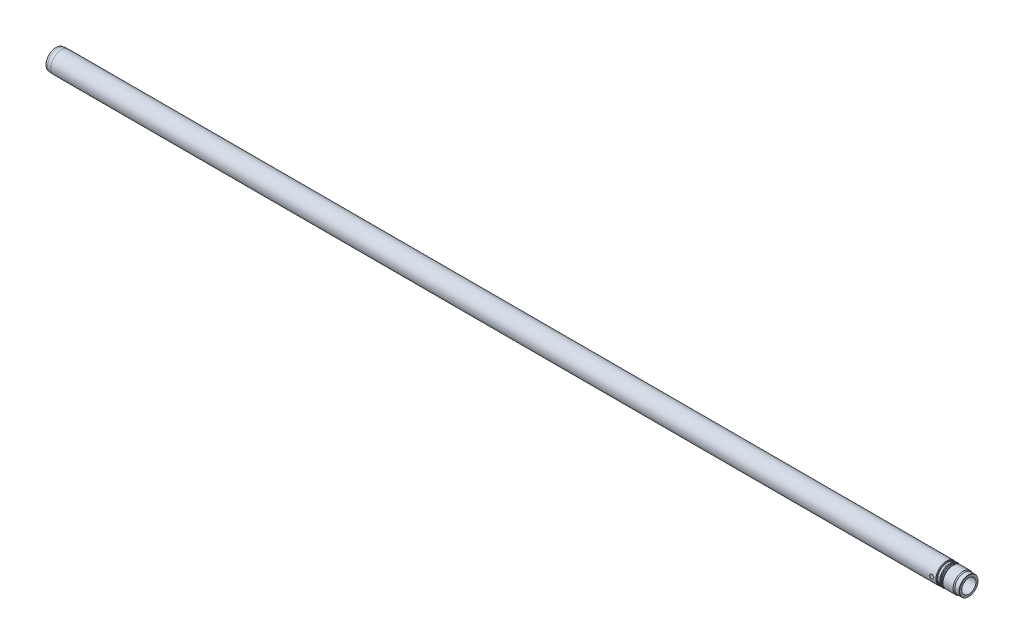
ISO-10303-21;
HEADER;
FILE_DESCRIPTION(('STEP AP214'),'2;1');
FILE_NAME('part.step','',(''),(''),'','','');
FILE_SCHEMA(('AUTOMOTIVE_DESIGN { 1 0 10303 214 1 1 1 1 }'));
ENDSEC;
DATA;
#1=APPLICATION_CONTEXT('core data for automotive mechanical design processes');
#2=APPLICATION_PROTOCOL_DEFINITION('international standard','automotive_design',2000,#1);
#3=PRODUCT_CONTEXT('',#1,'mechanical');
#4=PRODUCT('Part','Part','',(#3));
#5=PRODUCT_RELATED_PRODUCT_CATEGORY('part','',(#4));
#6=PRODUCT_DEFINITION_FORMATION('','',#4);
#7=PRODUCT_DEFINITION_CONTEXT('part definition',#1,'design');
#8=PRODUCT_DEFINITION('design','',#6,#7);
#9=PRODUCT_DEFINITION_SHAPE('','',#8);
#10=(LENGTH_UNIT() NAMED_UNIT(*) SI_UNIT(.MILLI.,.METRE.));
#11=(NAMED_UNIT(*) PLANE_ANGLE_UNIT() SI_UNIT($,.RADIAN.));
#12=(NAMED_UNIT(*) SI_UNIT($,.STERADIAN.) SOLID_ANGLE_UNIT());
#13=UNCERTAINTY_MEASURE_WITH_UNIT(LENGTH_MEASURE(1.E-05),#10,'distance_accuracy_value','');
#14=(GEOMETRIC_REPRESENTATION_CONTEXT(3) GLOBAL_UNCERTAINTY_ASSIGNED_CONTEXT((#13)) GLOBAL_UNIT_ASSIGNED_CONTEXT((#10,
#11,#12)) REPRESENTATION_CONTEXT('',''));
#15=CARTESIAN_POINT('',(0.,0.,0.));
#16=DIRECTION('',(0.,0.,1.));
#17=DIRECTION('',(1.,0.,0.));
#18=AXIS2_PLACEMENT_3D('',#15,#16,#17);
#19=CARTESIAN_POINT('',(0.,0.,0.));
#20=DIRECTION('',(-1.,0.,0.));
#21=DIRECTION('',(0.,0.,1.));
#22=AXIS2_PLACEMENT_3D('',#19,#20,#21);
#23=CONICAL_SURFACE('',#22,21.,0.5235987755983);
#24=CARTESIAN_POINT('',(6.9282032302755,0.,0.));
#25=DIRECTION('',(-1.,0.,0.));
#26=DIRECTION('',(0.,0.,1.));
#27=AXIS2_PLACEMENT_3D('',#24,#25,#26);
#28=CIRCLE('',#27,17.);
#29=CARTESIAN_POINT('',(6.9282032302755,0.,17.));
#30=VERTEX_POINT('',#29);
#31=EDGE_CURVE('E10',#30,#30,#28,.T.);
#32=ORIENTED_EDGE('',*,*,#31,.F.);
#33=EDGE_LOOP('',(#32));
#34=FACE_BOUND('',#33,.T.);
#35=CARTESIAN_POINT('',(0.,0.,0.));
#36=DIRECTION('',(-1.,0.,0.));
#37=DIRECTION('',(0.,0.,1.));
#38=AXIS2_PLACEMENT_3D('',#35,#36,#37);
#39=CIRCLE('',#38,21.);
#40=CARTESIAN_POINT('',(0.,0.,21.));
#41=VERTEX_POINT('',#40);
#42=EDGE_CURVE('E185',#41,#41,#39,.T.);
#43=ORIENTED_EDGE('',*,*,#42,.T.);
#44=EDGE_LOOP('',(#43));
#45=FACE_BOUND('',#44,.T.);
#46=ADVANCED_FACE('F43',(#34,#45),#23,.F.);
#47=CARTESIAN_POINT('',(0.,0.,0.));
#48=DIRECTION('',(-1.,0.,0.));
#49=DIRECTION('',(0.,0.,1.));
#50=AXIS2_PLACEMENT_3D('',#47,#48,#49);
#51=CYLINDRICAL_SURFACE('',#50,17.);
#52=CARTESIAN_POINT('',(2120.5,0.,17.0000000000001));
#53=CARTESIAN_POINT('',(2120.4999939727,0.248139786094189,16.9999961954987));
#54=CARTESIAN_POINT('',(2120.47940671072,0.496344480536842,16.9945135114712));
#55=CARTESIAN_POINT('',(2120.39774465018,0.98560820752433,16.973174315884));
#56=CARTESIAN_POINT('',(2120.33664995094,1.22666366691602,16.9573127053679));
#57=CARTESIAN_POINT('',(2120.17609514792,1.69449551647215,16.9169670511543));
#58=CARTESIAN_POINT('',(2120.07668410305,1.92128973608255,16.89249403667));
#59=CARTESIAN_POINT('',(2119.8424992788,2.35498604639753,16.8375143452415));
#60=CARTESIAN_POINT('',(2119.70772328063,2.5618868878873,16.8070072897539));
#61=CARTESIAN_POINT('',(2119.40337915686,2.95465619368835,16.7424751323481));
#62=CARTESIAN_POINT('',(2119.23315265612,3.14000475166026,16.7083905935436));
#63=CARTESIAN_POINT('',(2118.86414729992,3.47988446560833,16.640928241773));
#64=CARTESIAN_POINT('',(2118.66536483098,3.63441171550896,16.6075505188621));
#65=CARTESIAN_POINT('',(2118.24075395447,3.91078648059991,16.5446740227617));
#66=CARTESIAN_POINT('',(2118.01452540905,4.03203787997954,16.51525029638));
#67=CARTESIAN_POINT('',(2117.54398909092,4.23458020510499,16.4644862931428));
#68=CARTESIAN_POINT('',(2117.29968460691,4.31587837939244,16.4431445501692));
#69=CARTESIAN_POINT('',(2116.80568432275,4.43440473399748,16.4115742230544));
#70=CARTESIAN_POINT('',(2116.55622997909,4.4725746005264,16.4011085907812));
#71=CARTESIAN_POINT('',(2116.05425585675,4.50669636392591,16.3917670522188));
#72=CARTESIAN_POINT('',(2115.80173665031,4.50265602438469,16.3928890146598));
#73=CARTESIAN_POINT('',(2115.30813487029,4.45322011969829,16.4063836229733));
#74=CARTESIAN_POINT('',(2115.06692858361,4.40896191779174,16.4184468321885));
#75=CARTESIAN_POINT('',(2114.59549324368,4.28216736951903,16.4519695301458));
#76=CARTESIAN_POINT('',(2114.36526505785,4.19962800383794,16.473429760043));
#77=CARTESIAN_POINT('',(2113.91934632075,3.99768222492806,16.5236020010981));
#78=CARTESIAN_POINT('',(2113.70384627049,3.87787539054597,16.552392127192));
#79=CARTESIAN_POINT('',(2113.29560838492,3.6050749812119,16.6139379943506));
#80=CARTESIAN_POINT('',(2113.10287498213,3.45207496016852,16.6466945051376));
#81=CARTESIAN_POINT('',(2112.73914078256,3.11140669080736,16.7137721356031));
#82=CARTESIAN_POINT('',(2112.5690368451,2.9227827730169,16.7481097163477));
#83=CARTESIAN_POINT('',(2112.2626934722,2.51926736973085,16.8135364031183));
#84=CARTESIAN_POINT('',(2112.12645533296,2.3043748792807,16.8446253847784));
#85=CARTESIAN_POINT('',(2111.89132397923,1.85304666357207,16.9002386163945));
#86=CARTESIAN_POINT('',(2111.79259105471,1.61652371530397,16.9247345619699));
#87=CARTESIAN_POINT('',(2111.63654666082,1.12944054429494,16.9641969693575));
#88=CARTESIAN_POINT('',(2111.57922627709,0.878883355042802,16.979165481934));
#89=CARTESIAN_POINT('',(2111.50903761317,0.378499758438371,16.99757714526));
#90=CARTESIAN_POINT('',(2111.49494974273,0.128855796723722,17.0013364198686));
#91=CARTESIAN_POINT('',(2111.50826073824,-0.369227077901173,16.9978138879052));
#92=CARTESIAN_POINT('',(2111.53565538363,-0.617666110824258,16.9905332045684));
#93=CARTESIAN_POINT('',(2111.63015281242,-1.10194782952366,16.965952817481));
#94=CARTESIAN_POINT('',(2111.69657714815,-1.33793239097617,16.9488244024331));
#95=CARTESIAN_POINT('',(2111.86646212655,-1.79538752946389,16.9064898967349));
#96=CARTESIAN_POINT('',(2111.96992675219,-2.01685654260009,16.8812829374233));
#97=CARTESIAN_POINT('',(2112.21322970176,-2.4437464856342,16.8248446875656));
#98=CARTESIAN_POINT('',(2112.35373386753,-2.64877339136331,16.7935061472466));
#99=CARTESIAN_POINT('',(2112.66628874917,-3.03276827772521,16.7284282285679));
#100=CARTESIAN_POINT('',(2112.83834560154,-3.21173117715723,16.6946883839753));
#101=CARTESIAN_POINT('',(2113.21480997561,-3.54364355494935,16.6274504542848));
#102=CARTESIAN_POINT('',(2113.41998287879,-3.69573311976479,16.5939850732425));
#103=CARTESIAN_POINT('',(2113.8536440921,-3.96333980003505,16.5321164485774));
#104=CARTESIAN_POINT('',(2114.08213141823,-4.07885845816121,16.5037129914493));
#105=CARTESIAN_POINT('',(2114.55478257722,-4.26917454350181,16.4555094596447));
#106=CARTESIAN_POINT('',(2114.79884568015,-4.34420881494305,16.4356594855548));
#107=CARTESIAN_POINT('',(2115.29673856418,-4.45199494844993,16.4067947364221));
#108=CARTESIAN_POINT('',(2115.55056587738,-4.48475742334332,16.3977772417981));
#109=CARTESIAN_POINT('',(2116.05198474975,-4.5064661171717,16.3918232507795));
#110=CARTESIAN_POINT('',(2116.29951289327,-4.49679348202492,16.3945059290147));
#111=CARTESIAN_POINT('',(2116.78927335167,-4.4371051357649,16.4107597380706));
#112=CARTESIAN_POINT('',(2117.03150579891,-4.38709043411357,16.4243305964411));
#113=CARTESIAN_POINT('',(2117.50208906434,-4.24893296579958,16.4606067002154));
#114=CARTESIAN_POINT('',(2117.73053032532,-4.16107880659355,16.4832427143122));
#115=CARTESIAN_POINT('',(2118.16960250499,-3.94996082547737,16.5351012194015));
#116=CARTESIAN_POINT('',(2118.38023066107,-3.82669152406746,16.5643247294734));
#117=CARTESIAN_POINT('',(2118.78430015737,-3.54403917830604,16.6271251137984));
#118=CARTESIAN_POINT('',(2118.97706513554,-3.38371171107476,16.6608037314859));
#119=CARTESIAN_POINT('',(2119.33340368922,-3.03329563019924,16.7281467874237));
#120=CARTESIAN_POINT('',(2119.49697017825,-2.84319981272937,16.761811220259));
#121=CARTESIAN_POINT('',(2119.79363954504,-2.43382938444715,16.8261773921791));
#122=CARTESIAN_POINT('',(2119.92603111348,-2.21402616883115,16.8568021342468));
#123=CARTESIAN_POINT('',(2120.15177475838,-1.75448140910142,16.9107999106155));
#124=CARTESIAN_POINT('',(2120.24515224208,-1.51475296330045,16.934177661824));
#125=CARTESIAN_POINT('',(2120.37783337599,-1.0632142420448,16.9679716718455));
#126=CARTESIAN_POINT('',(2120.42354035917,-0.853375925202522,16.9798953831306));
#127=CARTESIAN_POINT('',(2120.48462482595,-0.429040947974698,16.9959108172613));
#128=CARTESIAN_POINT('',(2120.50000521128,-0.214544735254488,17.0000032894191));
#129=CARTESIAN_POINT('',(2120.5,0.,17.0000000000001));
#130=B_SPLINE_CURVE_WITH_KNOTS('',3,(#52,#53,#54,#55,#56,#57,#58,#59,#60,#61,#62,#63,#64,#65,
#66,#67,#68,#69,#70,#71,#72,#73,#74,#75,#76,#77,#78,#79,#80,#81,#82,#83,#84,#85,#86,#87,#88,#89,
#90,#91,#92,#93,#94,#95,#96,#97,#98,#99,#100,#101,#102,#103,#104,#105,#106,#107,#108,#109,#110,
#111,#112,#113,#114,#115,#116,#117,#118,#119,#120,#121,#122,#123,#124,#125,#126,#127,#128,#129),
.UNSPECIFIED.,.T.,.F.,(4,2,2,2,2,2,2,2,2,2,2,2,2,2,2,2,2,2,2,2,2,2,2,2,2,2,2,2,2,2,2,2,2,2,2,2,
2,2,4),(0.,0.743632635950677,1.48763087813262,2.23067967867778,2.97377510891817,3.7321491060706,
4.49061915321902,5.26190121593441,6.03304329655961,6.78700122339544,7.54082047960317,
8.27396339050186,9.00716413574137,9.74853201191125,10.4900439902362,11.2553725952915,
12.0207304886276,12.7893235247106,13.5577510664168,14.3042921594799,15.0507573025268,
15.7846153421823,16.5185523178613,17.266707986401,18.0150093138617,18.7840807596342,
19.5531197593254,20.3176095059617,21.0819072811555,21.8215171089269,22.5611084303385,
23.295155981525,24.0293171671978,24.7847891506876,25.5404442388059,26.3119567618968,
27.0829660649108,27.7259815891752,28.3689355850576),.UNSPECIFIED.);
#131=CARTESIAN_POINT('',(2120.5,0.,17.0000000000001));
#132=VERTEX_POINT('',#131);
#133=EDGE_CURVE('E90',#132,#132,#130,.T.);
#134=ORIENTED_EDGE('',*,*,#133,.T.);
#135=EDGE_LOOP('',(#134));
#136=FACE_BOUND('',#135,.T.);
#137=CARTESIAN_POINT('',(2120.5,0.,-16.9999999999999));
#138=CARTESIAN_POINT('',(2120.4999939727,-0.248139786094141,-16.9999961954986));
#139=CARTESIAN_POINT('',(2120.47940671072,-0.496344480536796,-16.994513511471));
#140=CARTESIAN_POINT('',(2120.39774465018,-0.985608207524279,-16.9731743158839));
#141=CARTESIAN_POINT('',(2120.33664995094,-1.22666366691596,-16.9573127053677));
#142=CARTESIAN_POINT('',(2120.17609514792,-1.69449551647217,-16.9169670511541));
#143=CARTESIAN_POINT('',(2120.07668410305,-1.92128973608265,-16.8924940366698));
#144=CARTESIAN_POINT('',(2119.8424992788,-2.35498604639761,-16.8375143452413));
#145=CARTESIAN_POINT('',(2119.70772328063,-2.5618868878873,-16.8070072897537));
#146=CARTESIAN_POINT('',(2119.40337915686,-2.95465619368829,-16.7424751323479));
#147=CARTESIAN_POINT('',(2119.23315265612,-3.14000475166021,-16.7083905935435));
#148=CARTESIAN_POINT('',(2118.86414729992,-3.47988446560828,-16.6409282417728));
#149=CARTESIAN_POINT('',(2118.66536483098,-3.63441171550891,-16.6075505188619));
#150=CARTESIAN_POINT('',(2118.24075395447,-3.91078648059986,-16.5446740227615));
#151=CARTESIAN_POINT('',(2118.01452540905,-4.0320378799795,-16.5152502963798));
#152=CARTESIAN_POINT('',(2117.54398909092,-4.23458020510494,-16.4644862931426));
#153=CARTESIAN_POINT('',(2117.29968460691,-4.31587837939239,-16.4431445501691));
#154=CARTESIAN_POINT('',(2116.80568432275,-4.43440473399743,-16.4115742230542));
#155=CARTESIAN_POINT('',(2116.55622997909,-4.47257460052635,-16.4011085907811));
#156=CARTESIAN_POINT('',(2116.05425585675,-4.50669636392586,-16.3917670522186));
#157=CARTESIAN_POINT('',(2115.80173665031,-4.50265602438464,-16.3928890146596));
#158=CARTESIAN_POINT('',(2115.30813487029,-4.45322011969825,-16.4063836229731));
#159=CARTESIAN_POINT('',(2115.06692858361,-4.4089619177917,-16.4184468321883));
#160=CARTESIAN_POINT('',(2114.59549324368,-4.28216736951898,-16.4519695301456));
#161=CARTESIAN_POINT('',(2114.36526505785,-4.1996280038379,-16.4734297600428));
#162=CARTESIAN_POINT('',(2113.91934632075,-3.99768222492802,-16.5236020010979));
#163=CARTESIAN_POINT('',(2113.70384627049,-3.87787539054593,-16.5523921271918));
#164=CARTESIAN_POINT('',(2113.29560838492,-3.60507498121185,-16.6139379943505));
#165=CARTESIAN_POINT('',(2113.10287498213,-3.45207496016847,-16.6466945051374));
#166=CARTESIAN_POINT('',(2112.73914078256,-3.11140669080731,-16.7137721356029));
#167=CARTESIAN_POINT('',(2112.5690368451,-2.92278277301685,-16.7481097163475));
#168=CARTESIAN_POINT('',(2112.2626934722,-2.51926736973081,-16.8135364031181));
#169=CARTESIAN_POINT('',(2112.12645533296,-2.30437487928065,-16.8446253847783));
#170=CARTESIAN_POINT('',(2111.89132397923,-1.85304666357202,-16.9002386163944));
#171=CARTESIAN_POINT('',(2111.79259105471,-1.61652371530392,-16.9247345619697));
#172=CARTESIAN_POINT('',(2111.63654666082,-1.1294405442949,-16.9641969693574));
#173=CARTESIAN_POINT('',(2111.57922627709,-0.878883355042754,-16.9791654819338));
#174=CARTESIAN_POINT('',(2111.50903761317,-0.378499758438323,-16.9975771452598));
#175=CARTESIAN_POINT('',(2111.49494974273,-0.128855796723673,-17.0013364198684));
#176=CARTESIAN_POINT('',(2111.50826073824,0.369227077901221,-16.997813887905));
#177=CARTESIAN_POINT('',(2111.53565538363,0.617666110824306,-16.9905332045682));
#178=CARTESIAN_POINT('',(2111.63015281242,1.10194782952371,-16.9659528174809));
#179=CARTESIAN_POINT('',(2111.69657714815,1.33793239097622,-16.9488244024329));
#180=CARTESIAN_POINT('',(2111.86646212655,1.79538752946394,-16.9064898967347));
#181=CARTESIAN_POINT('',(2111.96992675219,2.01685654260014,-16.8812829374231));
#182=CARTESIAN_POINT('',(2112.21322970176,2.44374648563425,-16.8248446875654));
#183=CARTESIAN_POINT('',(2112.35373386753,2.64877339136336,-16.7935061472464));
#184=CARTESIAN_POINT('',(2112.66628874917,3.03276827772526,-16.7284282285677));
#185=CARTESIAN_POINT('',(2112.83834560154,3.21173117715728,-16.6946883839752));
#186=CARTESIAN_POINT('',(2113.21480997561,3.5436435549494,-16.6274504542846));
#187=CARTESIAN_POINT('',(2113.41998287879,3.69573311976484,-16.5939850732424));
#188=CARTESIAN_POINT('',(2113.8536440921,3.9633398000351,-16.5321164485772));
#189=CARTESIAN_POINT('',(2114.08213141823,4.07885845816126,-16.5037129914491));
#190=CARTESIAN_POINT('',(2114.55478257722,4.26917454350185,-16.4555094596445));
#191=CARTESIAN_POINT('',(2114.79884568015,4.3442088149431,-16.4356594855547));
#192=CARTESIAN_POINT('',(2115.29673856418,4.45199494844997,-16.4067947364219));
#193=CARTESIAN_POINT('',(2115.55056587738,4.48475742334337,-16.3977772417979));
#194=CARTESIAN_POINT('',(2116.05198474975,4.50646611717174,-16.3918232507793));
#195=CARTESIAN_POINT('',(2116.29951289327,4.49679348202497,-16.3945059290145));
#196=CARTESIAN_POINT('',(2116.78927335167,4.43710513576495,-16.4107597380704));
#197=CARTESIAN_POINT('',(2117.03150579891,4.38709043411362,-16.4243305964409));
#198=CARTESIAN_POINT('',(2117.50208906434,4.24893296579963,-16.4606067002152));
#199=CARTESIAN_POINT('',(2117.73053032532,4.1610788065936,-16.483242714312));
#200=CARTESIAN_POINT('',(2118.16960250499,3.94996082547741,-16.5351012194013));
#201=CARTESIAN_POINT('',(2118.38023066107,3.82669152406751,-16.5643247294732));
#202=CARTESIAN_POINT('',(2118.78430015737,3.54403917830609,-16.6271251137982));
#203=CARTESIAN_POINT('',(2118.97706513554,3.38371171107481,-16.6608037314857));
#204=CARTESIAN_POINT('',(2119.33340368922,3.03329563019929,-16.7281467874236));
#205=CARTESIAN_POINT('',(2119.49697017825,2.84319981272942,-16.7618112202588));
#206=CARTESIAN_POINT('',(2119.79363954504,2.4338293844472,-16.826177392179));
#207=CARTESIAN_POINT('',(2119.92603111348,2.2140261688312,-16.8568021342466));
#208=CARTESIAN_POINT('',(2120.15177475838,1.75448140910147,-16.9107999106153));
#209=CARTESIAN_POINT('',(2120.24515224208,1.5147529633005,-16.9341776618238));
#210=CARTESIAN_POINT('',(2120.37783337599,1.06321424204485,-16.9679716718453));
#211=CARTESIAN_POINT('',(2120.42354035917,0.853375925202571,-16.9798953831304));
#212=CARTESIAN_POINT('',(2120.48462482595,0.429040947974746,-16.9959108172612));
#213=CARTESIAN_POINT('',(2120.50000521128,0.214544735254537,-17.0000032894189));
#214=CARTESIAN_POINT('',(2120.5,0.,-16.9999999999999));
#215=B_SPLINE_CURVE_WITH_KNOTS('',3,(#137,#138,#139,#140,#141,#142,#143,#144,#145,#146,#147,
#148,#149,#150,#151,#152,#153,#154,#155,#156,#157,#158,#159,#160,#161,#162,#163,#164,#165,#166,
#167,#168,#169,#170,#171,#172,#173,#174,#175,#176,#177,#178,#179,#180,#181,#182,#183,#184,#185,
#186,#187,#188,#189,#190,#191,#192,#193,#194,#195,#196,#197,#198,#199,#200,#201,#202,#203,#204,
#205,#206,#207,#208,#209,#210,#211,#212,#213,#214),.UNSPECIFIED.,.T.,.F.,(4,2,2,2,2,2,2,2,2,2,2,
2,2,2,2,2,2,2,2,2,2,2,2,2,2,2,2,2,2,2,2,2,2,2,2,2,2,2,4),(0.,0.743632635950676,1.48763087813262,
2.23067967867795,2.97377510891818,3.73214910607061,4.49061915321904,5.26190121593442,
6.03304329655962,6.78700122339545,7.54082047960318,8.27396339050188,9.00716413574139,
9.74853201191126,10.4900439902362,11.2553725952915,12.0207304886276,12.7893235247106,
13.5577510664168,14.3042921594799,15.0507573025268,15.7846153421823,16.5185523178613,
17.2667079864011,18.0150093138617,18.7840807596342,19.5531197593254,20.3176095059617,
21.0819072811555,21.8215171089269,22.5611084303385,23.295155981525,24.0293171671978,
24.7847891506876,25.5404442388059,26.3119567618968,27.0829660649108,27.7259815891752,
28.3689355850577),.UNSPECIFIED.);
#216=CARTESIAN_POINT('',(2120.5,0.,-16.9999999999999));
#217=VERTEX_POINT('',#216);
#218=EDGE_CURVE('E85',#217,#217,#215,.T.);
#219=ORIENTED_EDGE('',*,*,#218,.T.);
#220=EDGE_LOOP('',(#219));
#221=FACE_BOUND('',#220,.T.);
#222=CARTESIAN_POINT('',(2180.,0.,0.));
#223=DIRECTION('',(-1.,0.,0.));
#224=DIRECTION('',(0.,0.,1.));
#225=AXIS2_PLACEMENT_3D('',#222,#223,#224);
#226=CIRCLE('',#225,17.);
#227=CARTESIAN_POINT('',(2180.,0.,17.0000000000001));
#228=VERTEX_POINT('',#227);
#229=EDGE_CURVE('E55',#228,#228,#226,.T.);
#230=ORIENTED_EDGE('',*,*,#229,.F.);
#231=EDGE_LOOP('',(#230));
#232=FACE_BOUND('',#231,.T.);
#233=ORIENTED_EDGE('',*,*,#31,.T.);
#234=EDGE_LOOP('',(#233));
#235=FACE_BOUND('',#234,.T.);
#236=ADVANCED_FACE('F95',(#136,#221,#232,#235),#51,.F.);
#237=CARTESIAN_POINT('',(2180.,21.9226497308105,0.));
#238=DIRECTION('',(1.,0.,0.));
#239=DIRECTION('',(0.,0.,-1.));
#240=AXIS2_PLACEMENT_3D('',#237,#238,#239);
#241=PLANE('',#240);
#242=ORIENTED_EDGE('',*,*,#229,.T.);
#243=EDGE_LOOP('',(#242));
#244=FACE_BOUND('',#243,.T.);
#245=CARTESIAN_POINT('',(2180.,0.,0.));
#246=DIRECTION('',(-1.,0.,0.));
#247=DIRECTION('',(0.,0.,1.));
#248=AXIS2_PLACEMENT_3D('',#245,#246,#247);
#249=CIRCLE('',#248,21.9226497308105);
#250=CARTESIAN_POINT('',(2180.,0.,21.9226497308106));
#251=VERTEX_POINT('',#250);
#252=EDGE_CURVE('E60',#251,#251,#249,.T.);
#253=ORIENTED_EDGE('',*,*,#252,.F.);
#254=EDGE_LOOP('',(#253));
#255=FACE_BOUND('',#254,.T.);
#256=ADVANCED_FACE('F99',(#244,#255),#241,.T.);
#257=CARTESIAN_POINT('',(2180.,0.,0.));
#258=DIRECTION('',(-1.,0.,0.));
#259=DIRECTION('',(0.,0.,1.));
#260=AXIS2_PLACEMENT_3D('',#257,#258,#259);
#261=CONICAL_SURFACE('',#260,21.9226497308105,0.523598775598279);
#262=CARTESIAN_POINT('',(2179.,0.,0.));
#263=DIRECTION('',(-1.,0.,0.));
#264=DIRECTION('',(0.,0.,1.));
#265=AXIS2_PLACEMENT_3D('',#262,#263,#264);
#266=CIRCLE('',#265,22.5);
#267=CARTESIAN_POINT('',(2179.,0.,22.5000000000001));
#268=VERTEX_POINT('',#267);
#269=EDGE_CURVE('E254',#268,#268,#266,.T.);
#270=ORIENTED_EDGE('',*,*,#269,.F.);
#271=EDGE_LOOP('',(#270));
#272=FACE_BOUND('',#271,.T.);
#273=ORIENTED_EDGE('',*,*,#252,.T.);
#274=EDGE_LOOP('',(#273));
#275=FACE_BOUND('',#274,.T.);
#276=ADVANCED_FACE('F104',(#272,#275),#261,.T.);
#277=CARTESIAN_POINT('',(0.,0.,0.));
#278=DIRECTION('',(-1.,0.,0.));
#279=DIRECTION('',(0.,0.,1.));
#280=AXIS2_PLACEMENT_3D('',#277,#278,#279);
#281=CYLINDRICAL_SURFACE('',#280,22.5);
#282=CARTESIAN_POINT('',(2169.,0.,0.));
#283=DIRECTION('',(-1.,0.,0.));
#284=DIRECTION('',(0.,0.,1.));
#285=AXIS2_PLACEMENT_3D('',#282,#283,#284);
#286=CIRCLE('',#285,22.5);
#287=CARTESIAN_POINT('',(2169.,0.,22.5000000000001));
#288=VERTEX_POINT('',#287);
#289=EDGE_CURVE('E251',#288,#288,#286,.T.);
#290=ORIENTED_EDGE('',*,*,#289,.F.);
#291=EDGE_LOOP('',(#290));
#292=FACE_BOUND('',#291,.T.);
#293=ORIENTED_EDGE('',*,*,#269,.T.);
#294=EDGE_LOOP('',(#293));
#295=FACE_BOUND('',#294,.T.);
#296=ADVANCED_FACE('F108',(#292,#295),#281,.T.);
#297=CARTESIAN_POINT('',(2169.,0.,0.));
#298=DIRECTION('',(-1.,0.,0.));
#299=DIRECTION('',(0.,0.,1.));
#300=AXIS2_PLACEMENT_3D('',#297,#298,#299);
#301=CONICAL_SURFACE('',#300,22.5,0.523598775598334);
#302=CARTESIAN_POINT('',(2166.40192378865,0.,0.));
#303=DIRECTION('',(-1.,0.,0.));
#304=DIRECTION('',(0.,0.,1.));
#305=AXIS2_PLACEMENT_3D('',#302,#303,#304);
#306=CIRCLE('',#305,24.);
#307=CARTESIAN_POINT('',(2166.40192378865,0.,24.0000000000001));
#308=VERTEX_POINT('',#307);
#309=EDGE_CURVE('E248',#308,#308,#306,.T.);
#310=ORIENTED_EDGE('',*,*,#309,.F.);
#311=EDGE_LOOP('',(#310));
#312=FACE_BOUND('',#311,.T.);
#313=ORIENTED_EDGE('',*,*,#289,.T.);
#314=EDGE_LOOP('',(#313));
#315=FACE_BOUND('',#314,.T.);
#316=ADVANCED_FACE('F112',(#312,#315),#301,.T.);
#317=CARTESIAN_POINT('',(0.,0.,0.));
#318=DIRECTION('',(-1.,0.,0.));
#319=DIRECTION('',(0.,0.,1.));
#320=AXIS2_PLACEMENT_3D('',#317,#318,#319);
#321=CYLINDRICAL_SURFACE('',#320,24.);
#322=ORIENTED_EDGE('',*,*,#309,.T.);
#323=EDGE_LOOP('',(#322));
#324=FACE_BOUND('',#323,.T.);
#325=CARTESIAN_POINT('',(2142.45326313188,0.,0.));
#326=DIRECTION('',(-1.,0.,0.));
#327=DIRECTION('',(0.,0.,1.));
#328=AXIS2_PLACEMENT_3D('',#325,#326,#327);
#329=CIRCLE('',#328,24.);
#330=CARTESIAN_POINT('',(2142.45326313188,0.,24.0000000000001));
#331=VERTEX_POINT('',#330);
#332=EDGE_CURVE('E245',#331,#331,#329,.T.);
#333=ORIENTED_EDGE('',*,*,#332,.F.);
#334=EDGE_LOOP('',(#333));
#335=FACE_BOUND('',#334,.T.);
#336=ADVANCED_FACE('F116',(#324,#335),#321,.T.);
#337=CARTESIAN_POINT('',(2140.,0.,0.));
#338=DIRECTION('',(1.,0.,0.));
#339=DIRECTION('',(0.,0.,-1.));
#340=AXIS2_PLACEMENT_3D('',#337,#338,#339);
#341=CONICAL_SURFACE('',#340,22.75,0.471238898038433);
#342=ORIENTED_EDGE('',*,*,#332,.T.);
#343=EDGE_LOOP('',(#342));
#344=FACE_BOUND('',#343,.T.);
#345=CARTESIAN_POINT('',(2140.,0.,0.));
#346=DIRECTION('',(-1.,0.,0.));
#347=DIRECTION('',(0.,0.,1.));
#348=AXIS2_PLACEMENT_3D('',#345,#346,#347);
#349=CIRCLE('',#348,22.75);
#350=CARTESIAN_POINT('',(2140.,0.,22.7500000000001));
#351=VERTEX_POINT('',#350);
#352=EDGE_CURVE('E242',#351,#351,#349,.T.);
#353=ORIENTED_EDGE('',*,*,#352,.F.);
#354=EDGE_LOOP('',(#353));
#355=FACE_BOUND('',#354,.T.);
#356=ADVANCED_FACE('F120',(#344,#355),#341,.T.);
#357=CARTESIAN_POINT('',(0.,0.,0.));
#358=DIRECTION('',(-1.,0.,0.));
#359=DIRECTION('',(0.,0.,1.));
#360=AXIS2_PLACEMENT_3D('',#357,#358,#359);
#361=CYLINDRICAL_SURFACE('',#360,22.75);
#362=ORIENTED_EDGE('',*,*,#352,.T.);
#363=EDGE_LOOP('',(#362));
#364=FACE_BOUND('',#363,.T.);
#365=CARTESIAN_POINT('',(2137.8,0.,0.));
#366=DIRECTION('',(-1.,0.,0.));
#367=DIRECTION('',(0.,0.,1.));
#368=AXIS2_PLACEMENT_3D('',#365,#366,#367);
#369=CIRCLE('',#368,22.75);
#370=CARTESIAN_POINT('',(2137.8,0.,22.7500000000001));
#371=VERTEX_POINT('',#370);
#372=EDGE_CURVE('E239',#371,#371,#369,.T.);
#373=ORIENTED_EDGE('',*,*,#372,.F.);
#374=EDGE_LOOP('',(#373));
#375=FACE_BOUND('',#374,.T.);
#376=ADVANCED_FACE('F124',(#364,#375),#361,.T.);
#377=CARTESIAN_POINT('',(2137.8,0.,0.));
#378=DIRECTION('',(-1.,0.,0.));
#379=DIRECTION('',(0.,0.,1.));
#380=AXIS2_PLACEMENT_3D('',#377,#378,#379);
#381=TOROIDAL_SURFACE('',#380,23.55,0.799999999999955);
#382=ORIENTED_EDGE('',*,*,#372,.T.);
#383=EDGE_LOOP('',(#382));
#384=FACE_BOUND('',#383,.T.);
#385=CARTESIAN_POINT('',(2137.,0.,0.));
#386=DIRECTION('',(-1.,0.,0.));
#387=DIRECTION('',(0.,0.,1.));
#388=AXIS2_PLACEMENT_3D('',#385,#386,#387);
#389=CIRCLE('',#388,23.55);
#390=CARTESIAN_POINT('',(2137.,0.,23.5500000000001));
#391=VERTEX_POINT('',#390);
#392=EDGE_CURVE('E236',#391,#391,#389,.T.);
#393=ORIENTED_EDGE('',*,*,#392,.F.);
#394=EDGE_LOOP('',(#393));
#395=FACE_BOUND('',#394,.T.);
#396=ADVANCED_FACE('F128',(#384,#395),#381,.F.);
#397=CARTESIAN_POINT('',(2137.,23.8839745962156,0.));
#398=DIRECTION('',(1.,0.,0.));
#399=DIRECTION('',(0.,0.,-1.));
#400=AXIS2_PLACEMENT_3D('',#397,#398,#399);
#401=PLANE('',#400);
#402=ORIENTED_EDGE('',*,*,#392,.T.);
#403=EDGE_LOOP('',(#402));
#404=FACE_BOUND('',#403,.T.);
#405=CARTESIAN_POINT('',(2137.,0.,0.));
#406=DIRECTION('',(-1.,0.,0.));
#407=DIRECTION('',(0.,0.,1.));
#408=AXIS2_PLACEMENT_3D('',#405,#406,#407);
#409=CIRCLE('',#408,23.8839745962155);
#410=CARTESIAN_POINT('',(2137.,0.,23.8839745962156));
#411=VERTEX_POINT('',#410);
#412=EDGE_CURVE('E233',#411,#411,#409,.T.);
#413=ORIENTED_EDGE('',*,*,#412,.F.);
#414=EDGE_LOOP('',(#413));
#415=FACE_BOUND('',#414,.T.);
#416=ADVANCED_FACE('F132',(#404,#415),#401,.T.);
#417=CARTESIAN_POINT('',(2135.5,0.,0.));
#418=DIRECTION('',(-1.,0.,0.));
#419=DIRECTION('',(0.,0.,1.));
#420=AXIS2_PLACEMENT_3D('',#417,#418,#419);
#421=CONICAL_SURFACE('',#420,24.75,0.523598775598298);
#422=ORIENTED_EDGE('',*,*,#412,.T.);
#423=EDGE_LOOP('',(#422));
#424=FACE_BOUND('',#423,.T.);
#425=CARTESIAN_POINT('',(2135.5,0.,0.));
#426=DIRECTION('',(-1.,0.,0.));
#427=DIRECTION('',(0.,0.,1.));
#428=AXIS2_PLACEMENT_3D('',#425,#426,#427);
#429=CIRCLE('',#428,24.75);
#430=CARTESIAN_POINT('',(2135.5,0.,24.7500000000001));
#431=VERTEX_POINT('',#430);
#432=EDGE_CURVE('E230',#431,#431,#429,.T.);
#433=ORIENTED_EDGE('',*,*,#432,.F.);
#434=EDGE_LOOP('',(#433));
#435=FACE_BOUND('',#434,.T.);
#436=ADVANCED_FACE('F136',(#424,#435),#421,.T.);
#437=CARTESIAN_POINT('',(0.,0.,0.));
#438=DIRECTION('',(-1.,0.,0.));
#439=DIRECTION('',(0.,0.,1.));
#440=AXIS2_PLACEMENT_3D('',#437,#438,#439);
#441=CYLINDRICAL_SURFACE('',#440,24.75);
#442=ORIENTED_EDGE('',*,*,#432,.T.);
#443=EDGE_LOOP('',(#442));
#444=FACE_BOUND('',#443,.T.);
#445=CARTESIAN_POINT('',(2134.5,0.,0.));
#446=DIRECTION('',(-1.,0.,0.));
#447=DIRECTION('',(0.,0.,1.));
#448=AXIS2_PLACEMENT_3D('',#445,#446,#447);
#449=CIRCLE('',#448,24.7500000000001);
#450=CARTESIAN_POINT('',(2134.5,0.,24.7500000000002));
#451=VERTEX_POINT('',#450);
#452=EDGE_CURVE('E227',#451,#451,#449,.T.);
#453=ORIENTED_EDGE('',*,*,#452,.F.);
#454=EDGE_LOOP('',(#453));
#455=FACE_BOUND('',#454,.T.);
#456=ADVANCED_FACE('F140',(#444,#455),#441,.T.);
#457=CARTESIAN_POINT('',(2134.5,0.,0.));
#458=DIRECTION('',(-1.,0.,0.));
#459=DIRECTION('',(0.,0.,1.));
#460=AXIS2_PLACEMENT_3D('',#457,#458,#459);
#461=TOROIDAL_SURFACE('',#460,24.25,0.500000000000084);
#462=ORIENTED_EDGE('',*,*,#452,.T.);
#463=EDGE_LOOP('',(#462));
#464=FACE_BOUND('',#463,.T.);
#465=CARTESIAN_POINT('',(2134.,0.,0.));
#466=DIRECTION('',(-1.,0.,0.));
#467=DIRECTION('',(0.,0.,1.));
#468=AXIS2_PLACEMENT_3D('',#465,#466,#467);
#469=CIRCLE('',#468,24.2500000000002);
#470=CARTESIAN_POINT('',(2134.,0.,24.2500000000003));
#471=VERTEX_POINT('',#470);
#472=EDGE_CURVE('E224',#471,#471,#469,.T.);
#473=ORIENTED_EDGE('',*,*,#472,.F.);
#474=EDGE_LOOP('',(#473));
#475=FACE_BOUND('',#474,.T.);
#476=ADVANCED_FACE('F144',(#464,#475),#461,.T.);
#477=CARTESIAN_POINT('',(2134.,23.8000000000003,0.));
#478=DIRECTION('',(-1.,0.,0.));
#479=DIRECTION('',(0.,0.,1.));
#480=AXIS2_PLACEMENT_3D('',#477,#478,#479);
#481=PLANE('',#480);
#482=ORIENTED_EDGE('',*,*,#472,.T.);
#483=EDGE_LOOP('',(#482));
#484=FACE_BOUND('',#483,.T.);
#485=CARTESIAN_POINT('',(2134.,0.,0.));
#486=DIRECTION('',(-1.,0.,0.));
#487=DIRECTION('',(0.,0.,1.));
#488=AXIS2_PLACEMENT_3D('',#485,#486,#487);
#489=CIRCLE('',#488,23.8000000000003);
#490=CARTESIAN_POINT('',(2134.,0.,23.8000000000004));
#491=VERTEX_POINT('',#490);
#492=EDGE_CURVE('E221',#491,#491,#489,.T.);
#493=ORIENTED_EDGE('',*,*,#492,.F.);
#494=EDGE_LOOP('',(#493));
#495=FACE_BOUND('',#494,.T.);
#496=ADVANCED_FACE('F148',(#484,#495),#481,.T.);
#497=CARTESIAN_POINT('',(2133.2,0.,0.));
#498=DIRECTION('',(-1.,0.,0.));
#499=DIRECTION('',(0.,0.,1.));
#500=AXIS2_PLACEMENT_3D('',#497,#498,#499);
#501=TOROIDAL_SURFACE('',#500,23.8,0.799999999999955);
#502=ORIENTED_EDGE('',*,*,#492,.T.);
#503=EDGE_LOOP('',(#502));
#504=FACE_BOUND('',#503,.T.);
#505=CARTESIAN_POINT('',(2133.2,0.,0.));
#506=DIRECTION('',(-1.,0.,0.));
#507=DIRECTION('',(0.,0.,1.));
#508=AXIS2_PLACEMENT_3D('',#505,#506,#507);
#509=CIRCLE('',#508,23.);
#510=CARTESIAN_POINT('',(2133.2,0.,23.0000000000001));
#511=VERTEX_POINT('',#510);
#512=EDGE_CURVE('E218',#511,#511,#509,.T.);
#513=ORIENTED_EDGE('',*,*,#512,.F.);
#514=EDGE_LOOP('',(#513));
#515=FACE_BOUND('',#514,.T.);
#516=ADVANCED_FACE('F152',(#504,#515),#501,.F.);
#517=CARTESIAN_POINT('',(0.,0.,0.));
#518=DIRECTION('',(-1.,0.,0.));
#519=DIRECTION('',(0.,0.,1.));
#520=AXIS2_PLACEMENT_3D('',#517,#518,#519);
#521=CYLINDRICAL_SURFACE('',#520,22.9999999999999);
#522=ORIENTED_EDGE('',*,*,#512,.T.);
#523=EDGE_LOOP('',(#522));
#524=FACE_BOUND('',#523,.T.);
#525=CARTESIAN_POINT('',(2128.8,0.,0.));
#526=DIRECTION('',(-1.,0.,0.));
#527=DIRECTION('',(0.,0.,1.));
#528=AXIS2_PLACEMENT_3D('',#525,#526,#527);
#529=CIRCLE('',#528,22.9999999999998);
#530=CARTESIAN_POINT('',(2128.8,0.,22.9999999999999));
#531=VERTEX_POINT('',#530);
#532=EDGE_CURVE('E215',#531,#531,#529,.T.);
#533=ORIENTED_EDGE('',*,*,#532,.F.);
#534=EDGE_LOOP('',(#533));
#535=FACE_BOUND('',#534,.T.);
#536=ADVANCED_FACE('F156',(#524,#535),#521,.T.);
#537=CARTESIAN_POINT('',(2128.8,0.,0.));
#538=DIRECTION('',(-1.,0.,0.));
#539=DIRECTION('',(0.,0.,1.));
#540=AXIS2_PLACEMENT_3D('',#537,#538,#539);
#541=TOROIDAL_SURFACE('',#540,23.8,0.800000000000179);
#542=ORIENTED_EDGE('',*,*,#532,.T.);
#543=EDGE_LOOP('',(#542));
#544=FACE_BOUND('',#543,.T.);
#545=CARTESIAN_POINT('',(2128.,0.,0.));
#546=DIRECTION('',(-1.,0.,0.));
#547=DIRECTION('',(0.,0.,1.));
#548=AXIS2_PLACEMENT_3D('',#545,#546,#547);
#549=CIRCLE('',#548,23.7999999999997);
#550=CARTESIAN_POINT('',(2128.,0.,23.7999999999998));
#551=VERTEX_POINT('',#550);
#552=EDGE_CURVE('E212',#551,#551,#549,.T.);
#553=ORIENTED_EDGE('',*,*,#552,.F.);
#554=EDGE_LOOP('',(#553));
#555=FACE_BOUND('',#554,.T.);
#556=ADVANCED_FACE('F160',(#544,#555),#541,.F.);
#557=CARTESIAN_POINT('',(2128.,24.1339745962155,0.));
#558=DIRECTION('',(1.,0.,0.));
#559=DIRECTION('',(0.,0.,-1.));
#560=AXIS2_PLACEMENT_3D('',#557,#558,#559);
#561=PLANE('',#560);
#562=ORIENTED_EDGE('',*,*,#552,.T.);
#563=EDGE_LOOP('',(#562));
#564=FACE_BOUND('',#563,.T.);
#565=CARTESIAN_POINT('',(2128.,0.,0.));
#566=DIRECTION('',(-1.,0.,0.));
#567=DIRECTION('',(0.,0.,1.));
#568=AXIS2_PLACEMENT_3D('',#565,#566,#567);
#569=CIRCLE('',#568,24.1339745962155);
#570=CARTESIAN_POINT('',(2128.,0.,24.1339745962156));
#571=VERTEX_POINT('',#570);
#572=EDGE_CURVE('E210',#571,#571,#569,.T.);
#573=ORIENTED_EDGE('',*,*,#572,.F.);
#574=EDGE_LOOP('',(#573));
#575=FACE_BOUND('',#574,.T.);
#576=ADVANCED_FACE('F164',(#564,#575),#561,.T.);
#577=CARTESIAN_POINT('',(2126.5,0.,0.));
#578=DIRECTION('',(-1.,0.,0.));
#579=DIRECTION('',(0.,0.,1.));
#580=AXIS2_PLACEMENT_3D('',#577,#578,#579);
#581=CONICAL_SURFACE('',#580,25.,0.5235987755983);
#582=ORIENTED_EDGE('',*,*,#572,.T.);
#583=EDGE_LOOP('',(#582));
#584=FACE_BOUND('',#583,.T.);
#585=CARTESIAN_POINT('',(2126.5,0.,0.));
#586=DIRECTION('',(-1.,0.,0.));
#587=DIRECTION('',(0.,0.,1.));
#588=AXIS2_PLACEMENT_3D('',#585,#586,#587);
#589=CIRCLE('',#588,25.);
#590=CARTESIAN_POINT('',(2126.5,0.,25.0000000000001));
#591=VERTEX_POINT('',#590);
#592=EDGE_CURVE('E207',#591,#591,#589,.T.);
#593=ORIENTED_EDGE('',*,*,#592,.F.);
#594=EDGE_LOOP('',(#593));
#595=FACE_BOUND('',#594,.T.);
#596=ADVANCED_FACE('F167',(#584,#595),#581,.T.);
#597=CARTESIAN_POINT('',(0.,0.,0.));
#598=DIRECTION('',(-1.,0.,0.));
#599=DIRECTION('',(0.,0.,1.));
#600=AXIS2_PLACEMENT_3D('',#597,#598,#599);
#601=CYLINDRICAL_SURFACE('',#600,25.);
#602=CARTESIAN_POINT('',(2120.5,0.,25.0000000000001));
#603=CARTESIAN_POINT('',(2120.49999023795,0.250597363973652,24.9999955349824));
#604=CARTESIAN_POINT('',(2120.47899625538,0.501323876917283,24.9961930246659));
#605=CARTESIAN_POINT('',(2120.39562192969,0.995723957330917,24.9813904308186));
#606=CARTESIAN_POINT('',(2120.33320549,1.23939117970393,24.9703840697863));
#607=CARTESIAN_POINT('',(2120.1689491631,1.71244999616232,24.9424062116719));
#608=CARTESIAN_POINT('',(2120.06714363575,1.94185383059264,24.9254399147403));
#609=CARTESIAN_POINT('',(2119.82709380353,2.38030017518697,24.887399642339));
#610=CARTESIAN_POINT('',(2119.68885289902,2.58934458292264,24.8663260502344));
#611=CARTESIAN_POINT('',(2119.37822968753,2.98347784104048,24.8221399679868));
#612=CARTESIAN_POINT('',(2119.2055223229,3.16830850004224,24.7990093268508));
#613=CARTESIAN_POINT('',(2118.83156816139,3.50653520488928,24.7534523836026));
#614=CARTESIAN_POINT('',(2118.63031941201,3.65992909841639,24.7310261298053));
#615=CARTESIAN_POINT('',(2118.20318937983,3.93198738992555,24.6892410288133));
#616=CARTESIAN_POINT('',(2117.97714004226,4.05039185622206,24.6699056064479));
#617=CARTESIAN_POINT('',(2117.50795273725,4.24744691783951,24.6367457883014));
#618=CARTESIAN_POINT('',(2117.2648161249,4.3261006615015,24.6229209560883));
#619=CARTESIAN_POINT('',(2116.77110938519,4.44059853206726,24.6025296249145));
#620=CARTESIAN_POINT('',(2116.52064650403,4.47689129643586,24.595887115759));
#621=CARTESIAN_POINT('',(2116.01710500467,4.50702896793646,24.5903830912278));
#622=CARTESIAN_POINT('',(2115.76402660421,4.50087738040711,24.5915209332984));
#623=CARTESIAN_POINT('',(2115.2656704291,4.44666536598006,24.6013797705314));
#624=CARTESIAN_POINT('',(2115.02033532668,4.39911277131214,24.6100088728769));
#625=CARTESIAN_POINT('',(2114.54118312945,4.26424730205601,24.6337337991101));
#626=CARTESIAN_POINT('',(2114.30736648951,4.17693285860261,24.6488298781609));
#627=CARTESIAN_POINT('',(2113.85638971376,3.96451882360144,24.6838850704583));
#628=CARTESIAN_POINT('',(2113.63932932949,3.83921201164662,24.7038707343535));
#629=CARTESIAN_POINT('',(2113.22912399372,3.55451700057618,24.7464353447752));
#630=CARTESIAN_POINT('',(2113.03598128743,3.39512560565809,24.7690145343812));
#631=CARTESIAN_POINT('',(2112.67615772621,3.04403715860646,24.8146237678445));
#632=CARTESIAN_POINT('',(2112.50990112735,2.85190522880331,24.8376556021256));
#633=CARTESIAN_POINT('',(2112.2119181933,2.44225060557961,24.8812735297551));
#634=CARTESIAN_POINT('',(2112.08019215481,2.22472769402302,24.9018596020887));
#635=CARTESIAN_POINT('',(2111.85495602874,1.7700395377419,24.9383032656858));
#636=CARTESIAN_POINT('',(2111.76148758309,1.53285322593565,24.9541556995184));
#637=CARTESIAN_POINT('',(2111.61583561398,1.04579850607965,24.9793055791383));
#638=CARTESIAN_POINT('',(2111.56364805374,0.795931340606883,24.9886036658513));
#639=CARTESIAN_POINT('',(2111.50262404019,0.294260216988838,24.9995098648127));
#640=CARTESIAN_POINT('',(2111.49320587958,0.0425291868628073,25.0012211575049));
#641=CARTESIAN_POINT('',(2111.51643119206,-0.458911723408994,24.9970450682726));
#642=CARTESIAN_POINT('',(2111.5490727668,-0.708621694262531,24.9911580292955));
#643=CARTESIAN_POINT('',(2111.65500723334,-1.1971050492539,24.9725108511795));
#644=CARTESIAN_POINT('',(2111.72800814684,-1.43594380194826,24.9598000968949));
#645=CARTESIAN_POINT('',(2111.91227485694,-1.89799257184653,24.9289247642724));
#646=CARTESIAN_POINT('',(2112.02354308945,-2.12120159304633,24.9107598387569));
#647=CARTESIAN_POINT('',(2112.28249009815,-2.54815393884946,24.8707339593878));
#648=CARTESIAN_POINT('',(2112.43052728113,-2.75167647822467,24.848837332733));
#649=CARTESIAN_POINT('',(2112.75832200235,-3.13119917221326,24.8038743164274));
#650=CARTESIAN_POINT('',(2112.93808225507,-3.30719696915646,24.7808078267942));
#651=CARTESIAN_POINT('',(2113.32684499817,-3.62886457227534,24.7357657200146));
#652=CARTESIAN_POINT('',(2113.53617702245,-3.77413883025359,24.7138068137446));
#653=CARTESIAN_POINT('',(2113.97661530185,-4.02746147197332,24.6737931763475));
#654=CARTESIAN_POINT('',(2114.20772078851,-4.13551116890387,24.6557383075041));
#655=CARTESIAN_POINT('',(2114.68410367224,-4.31074517708683,24.625706003715));
#656=CARTESIAN_POINT('',(2114.92931041549,-4.37811658335157,24.6137007869683));
#657=CARTESIAN_POINT('',(2115.42779735803,-4.47066328367819,24.5970611969284));
#658=CARTESIAN_POINT('',(2115.68107672277,-4.49584292516952,24.5924260642259));
#659=CARTESIAN_POINT('',(2116.18456194742,-4.50315482559023,24.5910878378626));
#660=CARTESIAN_POINT('',(2116.43475866331,-4.48591048444928,24.5942698737029));
#661=CARTESIAN_POINT('',(2116.9286262216,-4.41022247631835,24.6079538411194));
#662=CARTESIAN_POINT('',(2117.17229709593,-4.35177901099426,24.6184557368654));
#663=CARTESIAN_POINT('',(2117.64589578424,-4.19560591177261,24.6455494917391));
#664=CARTESIAN_POINT('',(2117.87584475423,-4.09793864892302,24.6621316787721));
#665=CARTESIAN_POINT('',(2118.31619323334,-3.86615687487549,24.6995253290602));
#666=CARTESIAN_POINT('',(2118.52659151135,-3.7320400705622,24.7203370583838));
#667=CARTESIAN_POINT('',(2118.92499910876,-3.42897741944,24.7642042764879));
#668=CARTESIAN_POINT('',(2119.11265894808,-3.25957598277668,24.787286792053));
#669=CARTESIAN_POINT('',(2119.45709859906,-2.89170727952939,24.8328876755424));
#670=CARTESIAN_POINT('',(2119.61387129989,-2.69323333818778,24.8554059125197));
#671=CARTESIAN_POINT('',(2119.8932788153,-2.27090824238864,24.8975568201725));
#672=CARTESIAN_POINT('',(2120.01562311176,-2.04686231241921,24.9171643109948));
#673=CARTESIAN_POINT('',(2120.22074281003,-1.58112288437945,24.9510392243991));
#674=CARTESIAN_POINT('',(2120.30355622072,-1.33944659673407,24.9653117736425));
#675=CARTESIAN_POINT('',(2120.41001277595,-0.914142661867474,24.9839218868527));
#676=CARTESIAN_POINT('',(2120.44370168772,-0.733035393798892,24.9899178167024));
#677=CARTESIAN_POINT('',(2120.48869863631,-0.367975256206719,24.9979584689489));
#678=CARTESIAN_POINT('',(2120.50000716862,-0.184022449771331,25.0000032788194));
#679=CARTESIAN_POINT('',(2120.5,0.,25.0000000000001));
#680=B_SPLINE_CURVE_WITH_KNOTS('',3,(#602,#603,#604,#605,#606,#607,#608,#609,#610,#611,#612,
#613,#614,#615,#616,#617,#618,#619,#620,#621,#622,#623,#624,#625,#626,#627,#628,#629,#630,#631,
#632,#633,#634,#635,#636,#637,#638,#639,#640,#641,#642,#643,#644,#645,#646,#647,#648,#649,#650,
#651,#652,#653,#654,#655,#656,#657,#658,#659,#660,#661,#662,#663,#664,#665,#666,#667,#668,#669,
#670,#671,#672,#673,#674,#675,#676,#677,#678,#679),.UNSPECIFIED.,.T.,.F.,(4,2,2,2,2,2,2,2,2,2,2,
2,2,2,2,2,2,2,2,2,2,2,2,2,2,2,2,2,2,2,2,2,2,2,2,2,2,2,4),(0.,0.751119234214581,1.50289387360239,
2.25401419876772,3.00506444969129,3.7635646098275,4.52211668334181,5.28616990310806,
6.05016259876089,6.80598838144995,7.56175174373445,8.30837334117106,9.05502440026928,
9.80582347634774,10.5566929789416,11.318448941486,12.0802114488214,12.8428009144691,
13.6053157989077,14.3574280220785,15.1095063001772,15.8562135718361,16.6029683841686,
17.357309381149,18.1117149569114,18.8753101422387,19.6388783870855,20.3989073934061,
21.158858081701,21.9077085429249,22.6565553386208,23.4042160535941,24.1519238163275,
24.9099617237519,25.668173942712,26.4326044530491,27.1962984767013,27.747883934638,
28.2994571808957),.UNSPECIFIED.);
#681=CARTESIAN_POINT('',(2120.5,0.,25.0000000000001));
#682=VERTEX_POINT('',#681);
#683=EDGE_CURVE('E46',#682,#682,#680,.T.);
#684=ORIENTED_EDGE('',*,*,#683,.F.);
#685=EDGE_LOOP('',(#684));
#686=FACE_BOUND('',#685,.T.);
#687=CARTESIAN_POINT('',(2120.5,0.,-24.9999999999999));
#688=CARTESIAN_POINT('',(2120.49999023795,-0.250597363973604,-24.9999955349823));
#689=CARTESIAN_POINT('',(2120.47899625538,-0.501323876917237,-24.9961930246658));
#690=CARTESIAN_POINT('',(2120.39562192969,-0.995723957330865,-24.9813904308184));
#691=CARTESIAN_POINT('',(2120.33320549,-1.23939117970388,-24.9703840697861));
#692=CARTESIAN_POINT('',(2120.1689491631,-1.71244999616234,-24.9424062116717));
#693=CARTESIAN_POINT('',(2120.06714363575,-1.94185383059274,-24.9254399147402));
#694=CARTESIAN_POINT('',(2119.82709380353,-2.38030017518706,-24.8873996423388));
#695=CARTESIAN_POINT('',(2119.68885289902,-2.58934458292265,-24.8663260502342));
#696=CARTESIAN_POINT('',(2119.37822968753,-2.98347784104042,-24.8221399679866));
#697=CARTESIAN_POINT('',(2119.2055223229,-3.16830850004219,-24.7990093268506));
#698=CARTESIAN_POINT('',(2118.83156816139,-3.50653520488923,-24.7534523836024));
#699=CARTESIAN_POINT('',(2118.63031941201,-3.65992909841634,-24.7310261298051));
#700=CARTESIAN_POINT('',(2118.20318937983,-3.9319873899255,-24.6892410288131));
#701=CARTESIAN_POINT('',(2117.97714004226,-4.05039185622201,-24.6699056064477));
#702=CARTESIAN_POINT('',(2117.50795273725,-4.24744691783946,-24.6367457883012));
#703=CARTESIAN_POINT('',(2117.2648161249,-4.32610066150146,-24.6229209560881));
#704=CARTESIAN_POINT('',(2116.77110938519,-4.44059853206721,-24.6025296249143));
#705=CARTESIAN_POINT('',(2116.52064650403,-4.47689129643581,-24.5958871157589));
#706=CARTESIAN_POINT('',(2116.01710500467,-4.50702896793641,-24.5903830912276));
#707=CARTESIAN_POINT('',(2115.76402660421,-4.50087738040706,-24.5915209332982));
#708=CARTESIAN_POINT('',(2115.2656704291,-4.44666536598001,-24.6013797705312));
#709=CARTESIAN_POINT('',(2115.02033532668,-4.39911277131209,-24.6100088728767));
#710=CARTESIAN_POINT('',(2114.54118312945,-4.26424730205596,-24.6337337991099));
#711=CARTESIAN_POINT('',(2114.30736648951,-4.17693285860257,-24.6488298781608));
#712=CARTESIAN_POINT('',(2113.85638971376,-3.96451882360139,-24.6838850704581));
#713=CARTESIAN_POINT('',(2113.63932932949,-3.83921201164657,-24.7038707343533));
#714=CARTESIAN_POINT('',(2113.22912399372,-3.55451700057615,-24.7464353447751));
#715=CARTESIAN_POINT('',(2113.03598128743,-3.39512560565807,-24.769014534381));
#716=CARTESIAN_POINT('',(2112.67615772621,-3.04403715860648,-24.8146237678443));
#717=CARTESIAN_POINT('',(2112.50990112735,-2.85190522880334,-24.8376556021254));
#718=CARTESIAN_POINT('',(2112.2119181933,-2.44225060557967,-24.8812735297549));
#719=CARTESIAN_POINT('',(2112.08019215481,-2.22472769402306,-24.9018596020885));
#720=CARTESIAN_POINT('',(2111.85495602874,-1.77003953774189,-24.9383032656856));
#721=CARTESIAN_POINT('',(2111.76148758309,-1.53285322593561,-24.9541556995183));
#722=CARTESIAN_POINT('',(2111.61583561398,-1.0457985060796,-24.9793055791381));
#723=CARTESIAN_POINT('',(2111.56364805374,-0.795931340606833,-24.9886036658511));
#724=CARTESIAN_POINT('',(2111.50262404019,-0.294260216988792,-24.9995098648125));
#725=CARTESIAN_POINT('',(2111.49320587958,-0.0425291868627595,-25.0012211575047));
#726=CARTESIAN_POINT('',(2111.51643119206,0.458911723409043,-24.9970450682724));
#727=CARTESIAN_POINT('',(2111.5490727668,0.708621694262579,-24.9911580292953));
#728=CARTESIAN_POINT('',(2111.65500723334,1.19710504925395,-24.9725108511793));
#729=CARTESIAN_POINT('',(2111.72800814684,1.4359438019483,-24.9598000968947));
#730=CARTESIAN_POINT('',(2111.91227485694,1.89799257184658,-24.9289247642722));
#731=CARTESIAN_POINT('',(2112.02354308945,2.12120159304638,-24.9107598387567));
#732=CARTESIAN_POINT('',(2112.28249009815,2.54815393884951,-24.8707339593876));
#733=CARTESIAN_POINT('',(2112.43052728113,2.75167647822473,-24.8488373327328));
#734=CARTESIAN_POINT('',(2112.75832200235,3.13119917221331,-24.8038743164272));
#735=CARTESIAN_POINT('',(2112.93808225507,3.30719696915651,-24.780807826794));
#736=CARTESIAN_POINT('',(2113.32684499817,3.62886457227539,-24.7357657200144));
#737=CARTESIAN_POINT('',(2113.53617702245,3.77413883025364,-24.7138068137445));
#738=CARTESIAN_POINT('',(2113.97661530185,4.02746147197337,-24.6737931763474));
#739=CARTESIAN_POINT('',(2114.20772078851,4.13551116890391,-24.6557383075039));
#740=CARTESIAN_POINT('',(2114.68410367224,4.31074517708688,-24.6257060037149));
#741=CARTESIAN_POINT('',(2114.92931041549,4.37811658335162,-24.6137007869682));
#742=CARTESIAN_POINT('',(2115.42779735803,4.47066328367824,-24.5970611969282));
#743=CARTESIAN_POINT('',(2115.68107672277,4.49584292516957,-24.5924260642258));
#744=CARTESIAN_POINT('',(2116.18456194742,4.50315482559028,-24.5910878378624));
#745=CARTESIAN_POINT('',(2116.43475866331,4.48591048444933,-24.5942698737027));
#746=CARTESIAN_POINT('',(2116.9286262216,4.4102224763184,-24.6079538411192));
#747=CARTESIAN_POINT('',(2117.17229709593,4.3517790109943,-24.6184557368653));
#748=CARTESIAN_POINT('',(2117.64589578424,4.19560591177266,-24.6455494917389));
#749=CARTESIAN_POINT('',(2117.87584475423,4.09793864892307,-24.6621316787719));
#750=CARTESIAN_POINT('',(2118.31619323334,3.86615687487553,-24.6995253290601));
#751=CARTESIAN_POINT('',(2118.52659151135,3.73204007056224,-24.7203370583836));
#752=CARTESIAN_POINT('',(2118.92499910876,3.42897741944005,-24.7642042764877));
#753=CARTESIAN_POINT('',(2119.11265894808,3.25957598277673,-24.7872867920529));
#754=CARTESIAN_POINT('',(2119.45709859906,2.89170727952943,-24.8328876755422));
#755=CARTESIAN_POINT('',(2119.61387129989,2.69323333818783,-24.8554059125195));
#756=CARTESIAN_POINT('',(2119.8932788153,2.27090824238869,-24.8975568201723));
#757=CARTESIAN_POINT('',(2120.01562311176,2.04686231241926,-24.9171643109946));
#758=CARTESIAN_POINT('',(2120.22074281003,1.5811228843795,-24.9510392243989));
#759=CARTESIAN_POINT('',(2120.30355622072,1.33944659673412,-24.9653117736423));
#760=CARTESIAN_POINT('',(2120.41001277595,0.914142661867522,-24.9839218868526));
#761=CARTESIAN_POINT('',(2120.44370168772,0.73303539379894,-24.9899178167023));
#762=CARTESIAN_POINT('',(2120.48869863631,0.367975256206768,-24.9979584689487));
#763=CARTESIAN_POINT('',(2120.50000716862,0.18402244977138,-25.0000032788193));
#764=CARTESIAN_POINT('',(2120.5,0.,-24.9999999999999));
#765=B_SPLINE_CURVE_WITH_KNOTS('',3,(#687,#688,#689,#690,#691,#692,#693,#694,#695,#696,#697,
#698,#699,#700,#701,#702,#703,#704,#705,#706,#707,#708,#709,#710,#711,#712,#713,#714,#715,#716,
#717,#718,#719,#720,#721,#722,#723,#724,#725,#726,#727,#728,#729,#730,#731,#732,#733,#734,#735,
#736,#737,#738,#739,#740,#741,#742,#743,#744,#745,#746,#747,#748,#749,#750,#751,#752,#753,#754,
#755,#756,#757,#758,#759,#760,#761,#762,#763,#764),.UNSPECIFIED.,.T.,.F.,(4,2,2,2,2,2,2,2,2,2,2,
2,2,2,2,2,2,2,2,2,2,2,2,2,2,2,2,2,2,2,2,2,2,2,2,2,2,2,4),(0.,0.751119234214581,1.50289387360239,
2.25401419876789,3.0050644496913,3.76356460982751,4.52211668334183,5.28616990310808,
6.0501625987609,6.80598838144996,7.56175174373447,8.30837334117107,9.0550244002693,
9.80582347634776,10.5566929789417,11.3184489414856,12.0802114488213,12.842800914469,
13.6053157989077,14.3574280220785,15.1095063001772,15.8562135718361,16.6029683841685,
17.357309381149,18.1117149569114,18.8753101422387,19.6388783870855,20.398907393406,
21.158858081701,21.9077085429248,22.6565553386208,23.404216053594,24.1519238163275,
24.9099617237519,25.668173942712,26.4326044530491,27.1962984767013,27.747883934638,
28.2994571808957),.UNSPECIFIED.);
#766=CARTESIAN_POINT('',(2120.5,0.,-24.9999999999999));
#767=VERTEX_POINT('',#766);
#768=EDGE_CURVE('E63',#767,#767,#765,.T.);
#769=ORIENTED_EDGE('',*,*,#768,.F.);
#770=EDGE_LOOP('',(#769));
#771=FACE_BOUND('',#770,.T.);
#772=ORIENTED_EDGE('',*,*,#592,.T.);
#773=EDGE_LOOP('',(#772));
#774=FACE_BOUND('',#773,.T.);
#775=CARTESIAN_POINT('',(13.,0.,0.));
#776=DIRECTION('',(-1.,0.,0.));
#777=DIRECTION('',(0.,0.,1.));
#778=AXIS2_PLACEMENT_3D('',#775,#776,#777);
#779=CIRCLE('',#778,25.);
#780=CARTESIAN_POINT('',(13.,0.,25.));
#781=VERTEX_POINT('',#780);
#782=EDGE_CURVE('E204',#781,#781,#779,.T.);
#783=ORIENTED_EDGE('',*,*,#782,.F.);
#784=EDGE_LOOP('',(#783));
#785=FACE_BOUND('',#784,.T.);
#786=ADVANCED_FACE('F68',(#686,#771,#774,#785),#601,.T.);
#787=CARTESIAN_POINT('',(13.,25.,0.));
#788=DIRECTION('',(1.,0.,0.));
#789=DIRECTION('',(0.,0.,-1.));
#790=AXIS2_PLACEMENT_3D('',#787,#788,#789);
#791=PLANE('',#790);
#792=CARTESIAN_POINT('',(13.,0.,0.));
#793=DIRECTION('',(-1.,0.,0.));
#794=DIRECTION('',(0.,0.,1.));
#795=AXIS2_PLACEMENT_3D('',#792,#793,#794);
#796=CIRCLE('',#795,24.75);
#797=CARTESIAN_POINT('',(13.,0.,24.75));
#798=VERTEX_POINT('',#797);
#799=EDGE_CURVE('E201',#798,#798,#796,.T.);
#800=ORIENTED_EDGE('',*,*,#799,.F.);
#801=EDGE_LOOP('',(#800));
#802=FACE_BOUND('',#801,.T.);
#803=ORIENTED_EDGE('',*,*,#782,.T.);
#804=EDGE_LOOP('',(#803));
#805=FACE_BOUND('',#804,.T.);
#806=ADVANCED_FACE('F174',(#802,#805),#791,.F.);
#807=CARTESIAN_POINT('',(0.,0.,0.));
#808=DIRECTION('',(-1.,0.,0.));
#809=DIRECTION('',(0.,0.,1.));
#810=AXIS2_PLACEMENT_3D('',#807,#808,#809);
#811=CYLINDRICAL_SURFACE('',#810,24.75);
#812=ORIENTED_EDGE('',*,*,#799,.T.);
#813=EDGE_LOOP('',(#812));
#814=FACE_BOUND('',#813,.T.);
#815=CARTESIAN_POINT('',(5.,0.,0.));
#816=DIRECTION('',(-1.,0.,0.));
#817=DIRECTION('',(0.,0.,1.));
#818=AXIS2_PLACEMENT_3D('',#815,#816,#817);
#819=CIRCLE('',#818,24.75);
#820=CARTESIAN_POINT('',(5.,0.,24.75));
#821=VERTEX_POINT('',#820);
#822=EDGE_CURVE('E198',#821,#821,#819,.T.);
#823=ORIENTED_EDGE('',*,*,#822,.F.);
#824=EDGE_LOOP('',(#823));
#825=FACE_BOUND('',#824,.T.);
#826=ADVANCED_FACE('F297',(#814,#825),#811,.T.);
#827=CARTESIAN_POINT('',(5.,24.,0.));
#828=DIRECTION('',(-1.,0.,0.));
#829=DIRECTION('',(0.,0.,1.));
#830=AXIS2_PLACEMENT_3D('',#827,#828,#829);
#831=PLANE('',#830);
#832=ORIENTED_EDGE('',*,*,#822,.T.);
#833=EDGE_LOOP('',(#832));
#834=FACE_BOUND('',#833,.T.);
#835=CARTESIAN_POINT('',(5.,0.,0.));
#836=DIRECTION('',(-1.,0.,0.));
#837=DIRECTION('',(0.,0.,1.));
#838=AXIS2_PLACEMENT_3D('',#835,#836,#837);
#839=CIRCLE('',#838,24.);
#840=CARTESIAN_POINT('',(5.,0.,24.));
#841=VERTEX_POINT('',#840);
#842=EDGE_CURVE('E195',#841,#841,#839,.T.);
#843=ORIENTED_EDGE('',*,*,#842,.F.);
#844=EDGE_LOOP('',(#843));
#845=FACE_BOUND('',#844,.T.);
#846=ADVANCED_FACE('F303',(#834,#845),#831,.T.);
#847=CARTESIAN_POINT('',(0.,0.,0.));
#848=DIRECTION('',(-1.,0.,0.));
#849=DIRECTION('',(0.,0.,1.));
#850=AXIS2_PLACEMENT_3D('',#847,#848,#849);
#851=CYLINDRICAL_SURFACE('',#850,23.9999999999998);
#852=ORIENTED_EDGE('',*,*,#842,.T.);
#853=EDGE_LOOP('',(#852));
#854=FACE_BOUND('',#853,.T.);
#855=CARTESIAN_POINT('',(0.5,0.,0.));
#856=DIRECTION('',(-1.,0.,0.));
#857=DIRECTION('',(0.,0.,1.));
#858=AXIS2_PLACEMENT_3D('',#855,#856,#857);
#859=CIRCLE('',#858,23.9999999999997);
#860=CARTESIAN_POINT('',(0.500000000000001,0.,23.9999999999997));
#861=VERTEX_POINT('',#860);
#862=EDGE_CURVE('E189',#861,#861,#859,.T.);
#863=ORIENTED_EDGE('',*,*,#862,.F.);
#864=EDGE_LOOP('',(#863));
#865=FACE_BOUND('',#864,.T.);
#866=ADVANCED_FACE('F310',(#854,#865),#851,.T.);
#867=CARTESIAN_POINT('',(0.5,0.,0.));
#868=DIRECTION('',(1.,0.,0.));
#869=DIRECTION('',(0.,0.,-1.));
#870=AXIS2_PLACEMENT_3D('',#867,#868,#869);
#871=CONICAL_SURFACE('',#870,23.9999999999997,0.785398163397452);
#872=CARTESIAN_POINT('',(0.,0.,0.));
#873=DIRECTION('',(-1.,0.,0.));
#874=DIRECTION('',(0.,0.,1.));
#875=AXIS2_PLACEMENT_3D('',#872,#873,#874);
#876=CIRCLE('',#875,23.4999999999997);
#877=CARTESIAN_POINT('',(0.,0.,23.4999999999997));
#878=VERTEX_POINT('',#877);
#879=EDGE_CURVE('E187',#878,#878,#876,.T.);
#880=ORIENTED_EDGE('',*,*,#879,.F.);
#881=EDGE_LOOP('',(#880));
#882=FACE_BOUND('',#881,.T.);
#883=ORIENTED_EDGE('',*,*,#862,.T.);
#884=EDGE_LOOP('',(#883));
#885=FACE_BOUND('',#884,.T.);
#886=ADVANCED_FACE('F313',(#882,#885),#871,.T.);
#887=CARTESIAN_POINT('',(0.,21.,0.));
#888=DIRECTION('',(-1.,0.,0.));
#889=DIRECTION('',(0.,0.,1.));
#890=AXIS2_PLACEMENT_3D('',#887,#888,#889);
#891=PLANE('',#890);
#892=ORIENTED_EDGE('',*,*,#879,.T.);
#893=EDGE_LOOP('',(#892));
#894=FACE_BOUND('',#893,.T.);
#895=ORIENTED_EDGE('',*,*,#42,.F.);
#896=EDGE_LOOP('',(#895));
#897=FACE_BOUND('',#896,.T.);
#898=ADVANCED_FACE('F78',(#894,#897),#891,.T.);
#899=CARTESIAN_POINT('',(2116.,0.,-49.9999999999999));
#900=DIRECTION('',(0.,0.,1.));
#901=DIRECTION('',(1.,0.,0.));
#902=AXIS2_PLACEMENT_3D('',#899,#900,#901);
#903=CYLINDRICAL_SURFACE('',#902,4.50000000000025);
#904=ORIENTED_EDGE('',*,*,#768,.T.);
#905=EDGE_LOOP('',(#904));
#906=FACE_BOUND('',#905,.T.);
#907=ORIENTED_EDGE('',*,*,#218,.F.);
#908=EDGE_LOOP('',(#907));
#909=FACE_BOUND('',#908,.T.);
#910=ADVANCED_FACE('F76',(#906,#909),#903,.F.);
#911=ORIENTED_EDGE('',*,*,#683,.T.);
#912=EDGE_LOOP('',(#911));
#913=FACE_BOUND('',#912,.T.);
#914=ORIENTED_EDGE('',*,*,#133,.F.);
#915=EDGE_LOOP('',(#914));
#916=FACE_BOUND('',#915,.T.);
#917=ADVANCED_FACE('F72',(#913,#916),#903,.F.);
#918=CLOSED_SHELL('',(#46,#236,#256,#276,#296,#316,#336,#356,#376,#396,#416,#436,#456,#476,#496,
#516,#536,#556,#576,#596,#786,#806,#826,#846,#866,#886,#898,#910,#917));
#919=MANIFOLD_SOLID_BREP('B2',#918);
#920=ADVANCED_BREP_SHAPE_REPRESENTATION('',(#18,#919),#14);
#921=SHAPE_DEFINITION_REPRESENTATION(#9,#920);
ENDSEC;
END-ISO-10303-21;
